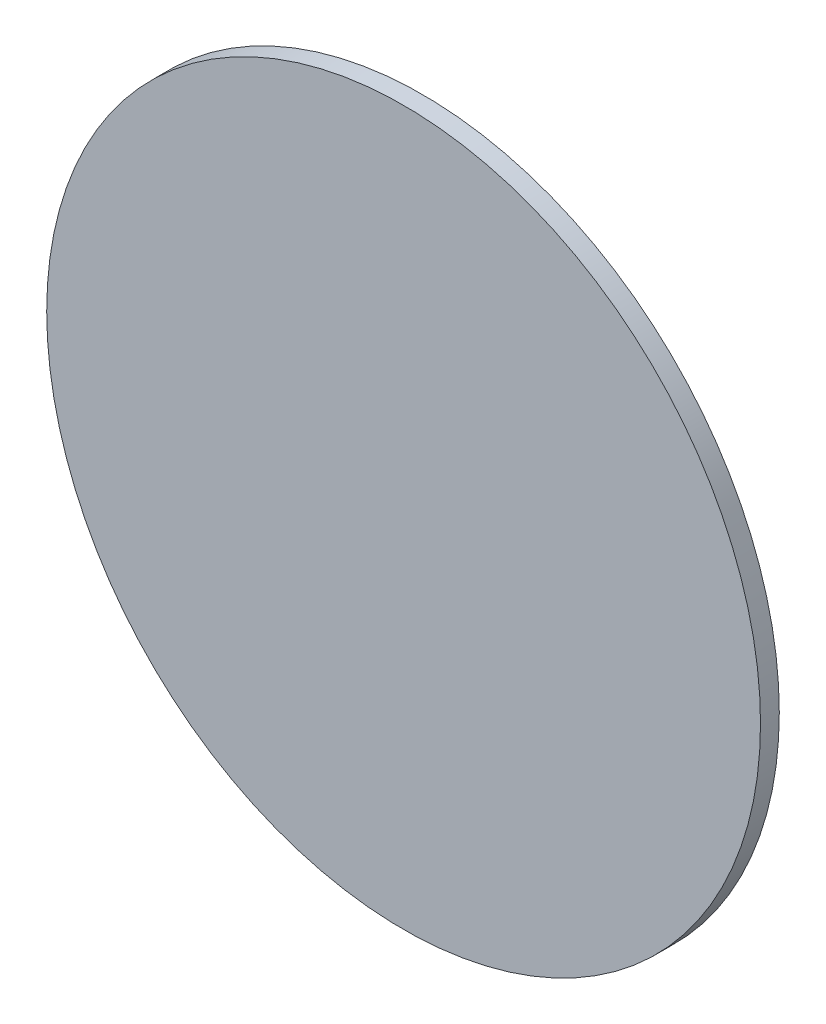
ISO-10303-21;
HEADER;
FILE_DESCRIPTION(('STEP AP214'),'2;1');
FILE_NAME('part.step','',(''),(''),'','','');
FILE_SCHEMA(('AUTOMOTIVE_DESIGN { 1 0 10303 214 1 1 1 1 }'));
ENDSEC;
DATA;
#1=APPLICATION_CONTEXT('core data for automotive mechanical design processes');
#2=APPLICATION_PROTOCOL_DEFINITION('international standard','automotive_design',2000,#1);
#3=PRODUCT_CONTEXT('',#1,'mechanical');
#4=PRODUCT('Part','Part','',(#3));
#5=PRODUCT_RELATED_PRODUCT_CATEGORY('part','',(#4));
#6=PRODUCT_DEFINITION_FORMATION('','',#4);
#7=PRODUCT_DEFINITION_CONTEXT('part definition',#1,'design');
#8=PRODUCT_DEFINITION('design','',#6,#7);
#9=PRODUCT_DEFINITION_SHAPE('','',#8);
#10=(LENGTH_UNIT() NAMED_UNIT(*) SI_UNIT(.MILLI.,.METRE.));
#11=(NAMED_UNIT(*) PLANE_ANGLE_UNIT() SI_UNIT($,.RADIAN.));
#12=(NAMED_UNIT(*) SI_UNIT($,.STERADIAN.) SOLID_ANGLE_UNIT());
#13=UNCERTAINTY_MEASURE_WITH_UNIT(LENGTH_MEASURE(1.E-05),#10,'distance_accuracy_value','');
#14=(GEOMETRIC_REPRESENTATION_CONTEXT(3) GLOBAL_UNCERTAINTY_ASSIGNED_CONTEXT((#13)) GLOBAL_UNIT_ASSIGNED_CONTEXT((#10,
#11,#12)) REPRESENTATION_CONTEXT('',''));
#15=CARTESIAN_POINT('',(0.,0.,0.));
#16=DIRECTION('',(0.,0.,1.));
#17=DIRECTION('',(1.,0.,0.));
#18=AXIS2_PLACEMENT_3D('',#15,#16,#17);
#19=CARTESIAN_POINT('',(0.,0.,0.4));
#20=DIRECTION('',(0.,0.,-1.));
#21=DIRECTION('',(-1.,0.,0.));
#22=AXIS2_PLACEMENT_3D('',#19,#20,#21);
#23=CYLINDRICAL_SURFACE('',#22,7.6);
#24=CARTESIAN_POINT('',(0.,0.,0.4));
#25=DIRECTION('',(0.,0.,1.));
#26=DIRECTION('',(1.,0.,0.));
#27=AXIS2_PLACEMENT_3D('',#24,#25,#26);
#28=CIRCLE('',#27,7.6);
#29=CARTESIAN_POINT('',(7.6,0.,0.4));
#30=VERTEX_POINT('',#29);
#31=EDGE_CURVE('E10',#30,#30,#28,.T.);
#32=ORIENTED_EDGE('',*,*,#31,.F.);
#33=EDGE_LOOP('',(#32));
#34=FACE_BOUND('',#33,.T.);
#35=CARTESIAN_POINT('',(0.,0.,0.));
#36=DIRECTION('',(0.,0.,1.));
#37=DIRECTION('',(1.,0.,0.));
#38=AXIS2_PLACEMENT_3D('',#35,#36,#37);
#39=CIRCLE('',#38,7.6);
#40=CARTESIAN_POINT('',(7.6,0.,0.));
#41=VERTEX_POINT('',#40);
#42=EDGE_CURVE('E38',#41,#41,#39,.T.);
#43=ORIENTED_EDGE('',*,*,#42,.T.);
#44=EDGE_LOOP('',(#43));
#45=FACE_BOUND('',#44,.T.);
#46=ADVANCED_FACE('F35',(#34,#45),#23,.T.);
#47=CARTESIAN_POINT('',(0.,0.,0.4));
#48=DIRECTION('',(0.,0.,1.));
#49=DIRECTION('',(1.,0.,0.));
#50=AXIS2_PLACEMENT_3D('',#47,#48,#49);
#51=PLANE('',#50);
#52=ORIENTED_EDGE('',*,*,#31,.T.);
#53=EDGE_LOOP('',(#52));
#54=FACE_BOUND('',#53,.T.);
#55=ADVANCED_FACE('F50',(#54),#51,.T.);
#56=CARTESIAN_POINT('',(0.,0.,0.));
#57=DIRECTION('',(0.,0.,1.));
#58=DIRECTION('',(1.,0.,0.));
#59=AXIS2_PLACEMENT_3D('',#56,#57,#58);
#60=PLANE('',#59);
#61=ORIENTED_EDGE('',*,*,#42,.F.);
#62=EDGE_LOOP('',(#61));
#63=FACE_BOUND('',#62,.T.);
#64=ADVANCED_FACE('F48',(#63),#60,.F.);
#65=CLOSED_SHELL('',(#46,#55,#64));
#66=MANIFOLD_SOLID_BREP('B2',#65);
#67=ADVANCED_BREP_SHAPE_REPRESENTATION('',(#18,#66),#14);
#68=SHAPE_DEFINITION_REPRESENTATION(#9,#67);
ENDSEC;
END-ISO-10303-21;
